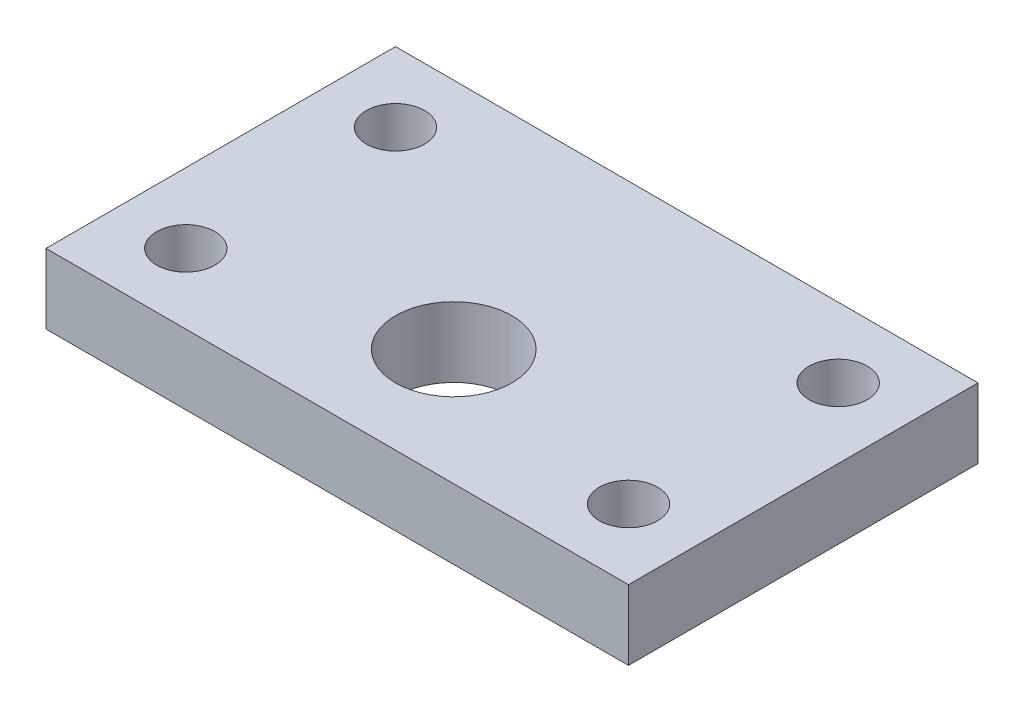
ISO-10303-21;
HEADER;
FILE_DESCRIPTION(('STEP AP214'),'2;1');
FILE_NAME('part.step','',(''),(''),'','','');
FILE_SCHEMA(('AUTOMOTIVE_DESIGN { 1 0 10303 214 1 1 1 1 }'));
ENDSEC;
DATA;
#1=APPLICATION_CONTEXT('core data for automotive mechanical design processes');
#2=APPLICATION_PROTOCOL_DEFINITION('international standard','automotive_design',2000,#1);
#3=PRODUCT_CONTEXT('',#1,'mechanical');
#4=PRODUCT('Part','Part','',(#3));
#5=PRODUCT_RELATED_PRODUCT_CATEGORY('part','',(#4));
#6=PRODUCT_DEFINITION_FORMATION('','',#4);
#7=PRODUCT_DEFINITION_CONTEXT('part definition',#1,'design');
#8=PRODUCT_DEFINITION('design','',#6,#7);
#9=PRODUCT_DEFINITION_SHAPE('','',#8);
#10=(LENGTH_UNIT() NAMED_UNIT(*) SI_UNIT(.MILLI.,.METRE.));
#11=(NAMED_UNIT(*) PLANE_ANGLE_UNIT() SI_UNIT($,.RADIAN.));
#12=(NAMED_UNIT(*) SI_UNIT($,.STERADIAN.) SOLID_ANGLE_UNIT());
#13=UNCERTAINTY_MEASURE_WITH_UNIT(LENGTH_MEASURE(1.E-05),#10,'distance_accuracy_value','');
#14=(GEOMETRIC_REPRESENTATION_CONTEXT(3) GLOBAL_UNCERTAINTY_ASSIGNED_CONTEXT((#13)) GLOBAL_UNIT_ASSIGNED_CONTEXT((#10,
#11,#12)) REPRESENTATION_CONTEXT('',''));
#15=CARTESIAN_POINT('',(0.,0.,0.));
#16=DIRECTION('',(0.,0.,1.));
#17=DIRECTION('',(1.,0.,0.));
#18=AXIS2_PLACEMENT_3D('',#15,#16,#17);
#19=CARTESIAN_POINT('',(0.,15.,0.));
#20=DIRECTION('',(0.,-1.,0.));
#21=DIRECTION('',(0.,0.,-1.));
#22=AXIS2_PLACEMENT_3D('',#19,#20,#21);
#23=PLANE('',#22);
#24=DIRECTION('',(0.,0.,-1.));
#25=VECTOR('',#24,1.);
#26=CARTESIAN_POINT('',(125.,15.,48.));
#27=LINE('',#26,#25);
#28=CARTESIAN_POINT('',(125.,15.,48.));
#29=VERTEX_POINT('',#28);
#30=CARTESIAN_POINT('',(125.,15.,-102.));
#31=VERTEX_POINT('',#30);
#32=EDGE_CURVE('E85',#29,#31,#27,.T.);
#33=ORIENTED_EDGE('',*,*,#32,.T.);
#34=DIRECTION('',(-1.,0.,0.));
#35=VECTOR('',#34,1.);
#36=CARTESIAN_POINT('',(-125.,15.,-102.));
#37=LINE('',#36,#35);
#38=CARTESIAN_POINT('',(-125.,15.,-102.));
#39=VERTEX_POINT('',#38);
#40=EDGE_CURVE('E80',#31,#39,#37,.T.);
#41=ORIENTED_EDGE('',*,*,#40,.T.);
#42=DIRECTION('',(0.,0.,1.));
#43=VECTOR('',#42,1.);
#44=CARTESIAN_POINT('',(-125.,15.,48.));
#45=LINE('',#44,#43);
#46=CARTESIAN_POINT('',(-125.,15.,48.));
#47=VERTEX_POINT('',#46);
#48=EDGE_CURVE('E83',#39,#47,#45,.T.);
#49=ORIENTED_EDGE('',*,*,#48,.T.);
#50=DIRECTION('',(1.,0.,0.));
#51=VECTOR('',#50,1.);
#52=CARTESIAN_POINT('',(-125.,15.,48.));
#53=LINE('',#52,#51);
#54=EDGE_CURVE('E50',#47,#29,#53,.T.);
#55=ORIENTED_EDGE('',*,*,#54,.T.);
#56=EDGE_LOOP('',(#33,#41,#49,#55));
#57=FACE_BOUND('',#56,.T.);
#58=CARTESIAN_POINT('',(-95.,15.,-71.9999999999999));
#59=DIRECTION('',(0.,1.,0.));
#60=DIRECTION('',(0.,0.,1.));
#61=AXIS2_PLACEMENT_3D('',#58,#59,#60);
#62=CIRCLE('',#61,12.5);
#63=CARTESIAN_POINT('',(-95.,15.,-59.4999999999999));
#64=VERTEX_POINT('',#63);
#65=EDGE_CURVE('E100',#64,#64,#62,.T.);
#66=ORIENTED_EDGE('',*,*,#65,.F.);
#67=EDGE_LOOP('',(#66));
#68=FACE_BOUND('',#67,.T.);
#69=CARTESIAN_POINT('',(0.,15.,-2.00000000000004));
#70=DIRECTION('',(0.,1.,0.));
#71=DIRECTION('',(0.,0.,1.));
#72=AXIS2_PLACEMENT_3D('',#69,#70,#71);
#73=CIRCLE('',#72,25.);
#74=CARTESIAN_POINT('',(0.,15.,23.));
#75=VERTEX_POINT('',#74);
#76=EDGE_CURVE('E115',#75,#75,#73,.T.);
#77=ORIENTED_EDGE('',*,*,#76,.F.);
#78=EDGE_LOOP('',(#77));
#79=FACE_BOUND('',#78,.T.);
#80=CARTESIAN_POINT('',(95.,15.,-71.9999999999999));
#81=DIRECTION('',(0.,1.,0.));
#82=DIRECTION('',(0.,0.,1.));
#83=AXIS2_PLACEMENT_3D('',#80,#81,#82);
#84=CIRCLE('',#83,12.5);
#85=CARTESIAN_POINT('',(95.,15.,-59.4999999999999));
#86=VERTEX_POINT('',#85);
#87=EDGE_CURVE('E121',#86,#86,#84,.T.);
#88=ORIENTED_EDGE('',*,*,#87,.F.);
#89=EDGE_LOOP('',(#88));
#90=FACE_BOUND('',#89,.T.);
#91=CARTESIAN_POINT('',(95.0000000000009,15.,18.0000000000001));
#92=DIRECTION('',(0.,1.,0.));
#93=DIRECTION('',(0.,0.,1.));
#94=AXIS2_PLACEMENT_3D('',#91,#92,#93);
#95=CIRCLE('',#94,12.5);
#96=CARTESIAN_POINT('',(95.0000000000009,15.,30.5000000000001));
#97=VERTEX_POINT('',#96);
#98=EDGE_CURVE('E127',#97,#97,#95,.T.);
#99=ORIENTED_EDGE('',*,*,#98,.F.);
#100=EDGE_LOOP('',(#99));
#101=FACE_BOUND('',#100,.T.);
#102=CARTESIAN_POINT('',(-94.9999999999991,15.,18.0000000000001));
#103=DIRECTION('',(0.,1.,0.));
#104=DIRECTION('',(0.,0.,1.));
#105=AXIS2_PLACEMENT_3D('',#102,#103,#104);
#106=CIRCLE('',#105,12.5);
#107=CARTESIAN_POINT('',(-94.9999999999991,15.,30.5000000000001));
#108=VERTEX_POINT('',#107);
#109=EDGE_CURVE('E133',#108,#108,#106,.T.);
#110=ORIENTED_EDGE('',*,*,#109,.F.);
#111=EDGE_LOOP('',(#110));
#112=FACE_BOUND('',#111,.T.);
#113=ADVANCED_FACE('F33',(#57,#68,#79,#90,#101,#112),#23,.F.);
#114=CARTESIAN_POINT('',(0.,-15.,0.));
#115=DIRECTION('',(0.,-1.,0.));
#116=DIRECTION('',(0.,0.,-1.));
#117=AXIS2_PLACEMENT_3D('',#114,#115,#116);
#118=PLANE('',#117);
#119=CARTESIAN_POINT('',(95.0000000000009,-15.,18.0000000000001));
#120=DIRECTION('',(0.,1.,0.));
#121=DIRECTION('',(0.,0.,1.));
#122=AXIS2_PLACEMENT_3D('',#119,#120,#121);
#123=CIRCLE('',#122,12.5);
#124=CARTESIAN_POINT('',(95.0000000000009,-15.,30.5000000000001));
#125=VERTEX_POINT('',#124);
#126=EDGE_CURVE('E130',#125,#125,#123,.T.);
#127=ORIENTED_EDGE('',*,*,#126,.T.);
#128=EDGE_LOOP('',(#127));
#129=FACE_BOUND('',#128,.T.);
#130=CARTESIAN_POINT('',(0.,-15.,-2.00000000000004));
#131=DIRECTION('',(0.,1.,0.));
#132=DIRECTION('',(0.,0.,1.));
#133=AXIS2_PLACEMENT_3D('',#130,#131,#132);
#134=CIRCLE('',#133,25.);
#135=CARTESIAN_POINT('',(0.,-15.,23.));
#136=VERTEX_POINT('',#135);
#137=EDGE_CURVE('E118',#136,#136,#134,.T.);
#138=ORIENTED_EDGE('',*,*,#137,.T.);
#139=EDGE_LOOP('',(#138));
#140=FACE_BOUND('',#139,.T.);
#141=DIRECTION('',(0.,0.,-1.));
#142=VECTOR('',#141,1.);
#143=CARTESIAN_POINT('',(125.,-15.,48.));
#144=LINE('',#143,#142);
#145=CARTESIAN_POINT('',(125.,-15.,48.));
#146=VERTEX_POINT('',#145);
#147=CARTESIAN_POINT('',(125.,-15.,-102.));
#148=VERTEX_POINT('',#147);
#149=EDGE_CURVE('E97',#146,#148,#144,.T.);
#150=ORIENTED_EDGE('',*,*,#149,.F.);
#151=DIRECTION('',(1.,0.,0.));
#152=VECTOR('',#151,1.);
#153=CARTESIAN_POINT('',(-125.,-15.,48.));
#154=LINE('',#153,#152);
#155=CARTESIAN_POINT('',(-125.,-15.,48.));
#156=VERTEX_POINT('',#155);
#157=EDGE_CURVE('E73',#156,#146,#154,.T.);
#158=ORIENTED_EDGE('',*,*,#157,.F.);
#159=DIRECTION('',(0.,0.,1.));
#160=VECTOR('',#159,1.);
#161=CARTESIAN_POINT('',(-125.,-15.,48.));
#162=LINE('',#161,#160);
#163=CARTESIAN_POINT('',(-125.,-15.,-102.));
#164=VERTEX_POINT('',#163);
#165=EDGE_CURVE('E67',#164,#156,#162,.T.);
#166=ORIENTED_EDGE('',*,*,#165,.F.);
#167=DIRECTION('',(-1.,0.,0.));
#168=VECTOR('',#167,1.);
#169=CARTESIAN_POINT('',(-125.,-15.,-102.));
#170=LINE('',#169,#168);
#171=EDGE_CURVE('E89',#148,#164,#170,.T.);
#172=ORIENTED_EDGE('',*,*,#171,.F.);
#173=EDGE_LOOP('',(#150,#158,#166,#172));
#174=FACE_BOUND('',#173,.T.);
#175=CARTESIAN_POINT('',(-95.,-15.,-71.9999999999999));
#176=DIRECTION('',(0.,1.,0.));
#177=DIRECTION('',(0.,0.,1.));
#178=AXIS2_PLACEMENT_3D('',#175,#176,#177);
#179=CIRCLE('',#178,12.5);
#180=CARTESIAN_POINT('',(-95.,-15.,-59.4999999999999));
#181=VERTEX_POINT('',#180);
#182=EDGE_CURVE('E112',#181,#181,#179,.T.);
#183=ORIENTED_EDGE('',*,*,#182,.T.);
#184=EDGE_LOOP('',(#183));
#185=FACE_BOUND('',#184,.T.);
#186=CARTESIAN_POINT('',(95.,-15.,-71.9999999999999));
#187=DIRECTION('',(0.,1.,0.));
#188=DIRECTION('',(0.,0.,1.));
#189=AXIS2_PLACEMENT_3D('',#186,#187,#188);
#190=CIRCLE('',#189,12.5);
#191=CARTESIAN_POINT('',(95.,-15.,-59.4999999999999));
#192=VERTEX_POINT('',#191);
#193=EDGE_CURVE('E124',#192,#192,#190,.T.);
#194=ORIENTED_EDGE('',*,*,#193,.T.);
#195=EDGE_LOOP('',(#194));
#196=FACE_BOUND('',#195,.T.);
#197=CARTESIAN_POINT('',(-94.9999999999991,-15.,18.0000000000001));
#198=DIRECTION('',(0.,1.,0.));
#199=DIRECTION('',(0.,0.,1.));
#200=AXIS2_PLACEMENT_3D('',#197,#198,#199);
#201=CIRCLE('',#200,12.5);
#202=CARTESIAN_POINT('',(-94.9999999999991,-15.,30.5000000000001));
#203=VERTEX_POINT('',#202);
#204=EDGE_CURVE('E136',#203,#203,#201,.T.);
#205=ORIENTED_EDGE('',*,*,#204,.T.);
#206=EDGE_LOOP('',(#205));
#207=FACE_BOUND('',#206,.T.);
#208=ADVANCED_FACE('F108',(#129,#140,#174,#185,#196,#207),#118,.T.);
#209=CARTESIAN_POINT('',(125.,15.,48.));
#210=DIRECTION('',(-1.,0.,0.));
#211=DIRECTION('',(0.,0.,1.));
#212=AXIS2_PLACEMENT_3D('',#209,#210,#211);
#213=PLANE('',#212);
#214=ORIENTED_EDGE('',*,*,#149,.T.);
#215=DIRECTION('',(0.,-1.,0.));
#216=VECTOR('',#215,1.);
#217=CARTESIAN_POINT('',(125.,15.,-102.));
#218=LINE('',#217,#216);
#219=EDGE_CURVE('E11',#31,#148,#218,.T.);
#220=ORIENTED_EDGE('',*,*,#219,.F.);
#221=ORIENTED_EDGE('',*,*,#32,.F.);
#222=DIRECTION('',(0.,-1.,0.));
#223=VECTOR('',#222,1.);
#224=CARTESIAN_POINT('',(125.,15.,48.));
#225=LINE('',#224,#223);
#226=EDGE_CURVE('E93',#29,#146,#225,.T.);
#227=ORIENTED_EDGE('',*,*,#226,.T.);
#228=EDGE_LOOP('',(#214,#220,#221,#227));
#229=FACE_BOUND('',#228,.T.);
#230=ADVANCED_FACE('F35',(#229),#213,.F.);
#231=CARTESIAN_POINT('',(-125.,15.,-102.));
#232=DIRECTION('',(0.,0.,1.));
#233=DIRECTION('',(1.,0.,0.));
#234=AXIS2_PLACEMENT_3D('',#231,#232,#233);
#235=PLANE('',#234);
#236=ORIENTED_EDGE('',*,*,#171,.T.);
#237=DIRECTION('',(0.,-1.,0.));
#238=VECTOR('',#237,1.);
#239=CARTESIAN_POINT('',(-125.,15.,-102.));
#240=LINE('',#239,#238);
#241=EDGE_CURVE('E42',#39,#164,#240,.T.);
#242=ORIENTED_EDGE('',*,*,#241,.F.);
#243=ORIENTED_EDGE('',*,*,#40,.F.);
#244=ORIENTED_EDGE('',*,*,#219,.T.);
#245=EDGE_LOOP('',(#236,#242,#243,#244));
#246=FACE_BOUND('',#245,.T.);
#247=ADVANCED_FACE('F88',(#246),#235,.F.);
#248=CARTESIAN_POINT('',(-125.,15.,48.));
#249=DIRECTION('',(1.,0.,0.));
#250=DIRECTION('',(0.,0.,-1.));
#251=AXIS2_PLACEMENT_3D('',#248,#249,#250);
#252=PLANE('',#251);
#253=ORIENTED_EDGE('',*,*,#165,.T.);
#254=DIRECTION('',(0.,-1.,0.));
#255=VECTOR('',#254,1.);
#256=CARTESIAN_POINT('',(-125.,15.,48.));
#257=LINE('',#256,#255);
#258=EDGE_CURVE('E90',#47,#156,#257,.T.);
#259=ORIENTED_EDGE('',*,*,#258,.F.);
#260=ORIENTED_EDGE('',*,*,#48,.F.);
#261=ORIENTED_EDGE('',*,*,#241,.T.);
#262=EDGE_LOOP('',(#253,#259,#260,#261));
#263=FACE_BOUND('',#262,.T.);
#264=ADVANCED_FACE('F91',(#263),#252,.F.);
#265=CARTESIAN_POINT('',(-125.,15.,48.));
#266=DIRECTION('',(0.,0.,-1.));
#267=DIRECTION('',(-1.,0.,0.));
#268=AXIS2_PLACEMENT_3D('',#265,#266,#267);
#269=PLANE('',#268);
#270=ORIENTED_EDGE('',*,*,#157,.T.);
#271=ORIENTED_EDGE('',*,*,#226,.F.);
#272=ORIENTED_EDGE('',*,*,#54,.F.);
#273=ORIENTED_EDGE('',*,*,#258,.T.);
#274=EDGE_LOOP('',(#270,#271,#272,#273));
#275=FACE_BOUND('',#274,.T.);
#276=ADVANCED_FACE('F105',(#275),#269,.F.);
#277=CARTESIAN_POINT('',(-95.,15.,-71.9999999999999));
#278=DIRECTION('',(0.,-1.,0.));
#279=DIRECTION('',(0.,0.,-1.));
#280=AXIS2_PLACEMENT_3D('',#277,#278,#279);
#281=CYLINDRICAL_SURFACE('',#280,12.5);
#282=ORIENTED_EDGE('',*,*,#65,.T.);
#283=EDGE_LOOP('',(#282));
#284=FACE_BOUND('',#283,.T.);
#285=ORIENTED_EDGE('',*,*,#182,.F.);
#286=EDGE_LOOP('',(#285));
#287=FACE_BOUND('',#286,.T.);
#288=ADVANCED_FACE('F153',(#284,#287),#281,.F.);
#289=CARTESIAN_POINT('',(0.,15.,-2.00000000000004));
#290=DIRECTION('',(0.,-1.,0.));
#291=DIRECTION('',(0.,0.,-1.));
#292=AXIS2_PLACEMENT_3D('',#289,#290,#291);
#293=CYLINDRICAL_SURFACE('',#292,25.);
#294=ORIENTED_EDGE('',*,*,#76,.T.);
#295=EDGE_LOOP('',(#294));
#296=FACE_BOUND('',#295,.T.);
#297=ORIENTED_EDGE('',*,*,#137,.F.);
#298=EDGE_LOOP('',(#297));
#299=FACE_BOUND('',#298,.T.);
#300=ADVANCED_FACE('F199',(#296,#299),#293,.F.);
#301=CARTESIAN_POINT('',(95.,15.,-71.9999999999999));
#302=DIRECTION('',(0.,-1.,0.));
#303=DIRECTION('',(0.,0.,-1.));
#304=AXIS2_PLACEMENT_3D('',#301,#302,#303);
#305=CYLINDRICAL_SURFACE('',#304,12.5);
#306=ORIENTED_EDGE('',*,*,#87,.T.);
#307=EDGE_LOOP('',(#306));
#308=FACE_BOUND('',#307,.T.);
#309=ORIENTED_EDGE('',*,*,#193,.F.);
#310=EDGE_LOOP('',(#309));
#311=FACE_BOUND('',#310,.T.);
#312=ADVANCED_FACE('F207',(#308,#311),#305,.F.);
#313=CARTESIAN_POINT('',(95.0000000000009,15.,18.0000000000001));
#314=DIRECTION('',(0.,-1.,0.));
#315=DIRECTION('',(0.,0.,-1.));
#316=AXIS2_PLACEMENT_3D('',#313,#314,#315);
#317=CYLINDRICAL_SURFACE('',#316,12.5);
#318=ORIENTED_EDGE('',*,*,#98,.T.);
#319=EDGE_LOOP('',(#318));
#320=FACE_BOUND('',#319,.T.);
#321=ORIENTED_EDGE('',*,*,#126,.F.);
#322=EDGE_LOOP('',(#321));
#323=FACE_BOUND('',#322,.T.);
#324=ADVANCED_FACE('F215',(#320,#323),#317,.F.);
#325=CARTESIAN_POINT('',(-94.9999999999991,15.,18.0000000000001));
#326=DIRECTION('',(0.,-1.,0.));
#327=DIRECTION('',(0.,0.,-1.));
#328=AXIS2_PLACEMENT_3D('',#325,#326,#327);
#329=CYLINDRICAL_SURFACE('',#328,12.5);
#330=ORIENTED_EDGE('',*,*,#109,.T.);
#331=EDGE_LOOP('',(#330));
#332=FACE_BOUND('',#331,.T.);
#333=ORIENTED_EDGE('',*,*,#204,.F.);
#334=EDGE_LOOP('',(#333));
#335=FACE_BOUND('',#334,.T.);
#336=ADVANCED_FACE('F142',(#332,#335),#329,.F.);
#337=CLOSED_SHELL('',(#113,#208,#230,#247,#264,#276,#288,#300,#312,#324,#336));
#338=MANIFOLD_SOLID_BREP('B2',#337);
#339=ADVANCED_BREP_SHAPE_REPRESENTATION('',(#18,#338),#14);
#340=SHAPE_DEFINITION_REPRESENTATION(#9,#339);
ENDSEC;
END-ISO-10303-21;
